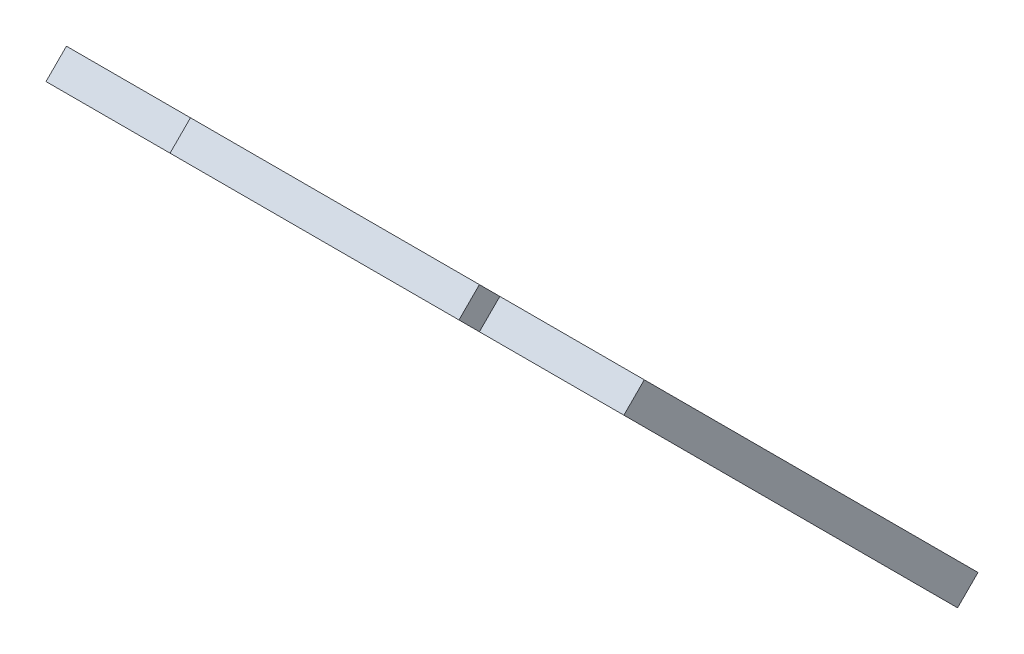
ISO-10303-21;
HEADER;
FILE_DESCRIPTION(('STEP AP214'),'2;1');
FILE_NAME('part.step','',(''),(''),'','','');
FILE_SCHEMA(('AUTOMOTIVE_DESIGN { 1 0 10303 214 1 1 1 1 }'));
ENDSEC;
DATA;
#1=APPLICATION_CONTEXT('core data for automotive mechanical design processes');
#2=APPLICATION_PROTOCOL_DEFINITION('international standard','automotive_design',2000,#1);
#3=PRODUCT_CONTEXT('',#1,'mechanical');
#4=PRODUCT('Part','Part','',(#3));
#5=PRODUCT_RELATED_PRODUCT_CATEGORY('part','',(#4));
#6=PRODUCT_DEFINITION_FORMATION('','',#4);
#7=PRODUCT_DEFINITION_CONTEXT('part definition',#1,'design');
#8=PRODUCT_DEFINITION('design','',#6,#7);
#9=PRODUCT_DEFINITION_SHAPE('','',#8);
#10=(LENGTH_UNIT() NAMED_UNIT(*) SI_UNIT(.MILLI.,.METRE.));
#11=(NAMED_UNIT(*) PLANE_ANGLE_UNIT() SI_UNIT($,.RADIAN.));
#12=(NAMED_UNIT(*) SI_UNIT($,.STERADIAN.) SOLID_ANGLE_UNIT());
#13=UNCERTAINTY_MEASURE_WITH_UNIT(LENGTH_MEASURE(1.E-05),#10,'distance_accuracy_value','');
#14=(GEOMETRIC_REPRESENTATION_CONTEXT(3) GLOBAL_UNCERTAINTY_ASSIGNED_CONTEXT((#13)) GLOBAL_UNIT_ASSIGNED_CONTEXT((#10,
#11,#12)) REPRESENTATION_CONTEXT('',''));
#15=CARTESIAN_POINT('',(0.,0.,0.));
#16=DIRECTION('',(0.,0.,1.));
#17=DIRECTION('',(1.,0.,0.));
#18=AXIS2_PLACEMENT_3D('',#15,#16,#17);
#19=CARTESIAN_POINT('',(0.,105.121320343559,-105.12132034356));
#20=DIRECTION('',(0.,0.707106781186546,-0.707106781186549));
#21=DIRECTION('',(0.,0.707106781186549,0.707106781186546));
#22=AXIS2_PLACEMENT_3D('',#19,#20,#21);
#23=PLANE('',#22);
#24=DIRECTION('',(0.,0.707106781186549,0.707106781186546));
#25=VECTOR('',#24,1.);
#26=CARTESIAN_POINT('',(-60.,175.12132034356,-35.1213203435597));
#27=LINE('',#26,#25);
#28=CARTESIAN_POINT('',(-60.,140.473088065419,-69.7695526217005));
#29=VERTEX_POINT('',#28);
#30=CARTESIAN_POINT('',(-60.,175.12132034356,-35.1213203435597));
#31=VERTEX_POINT('',#30);
#32=EDGE_CURVE('E160',#29,#31,#27,.T.);
#33=ORIENTED_EDGE('',*,*,#32,.T.);
#34=DIRECTION('',(1.,0.,0.));
#35=VECTOR('',#34,1.);
#36=CARTESIAN_POINT('',(-60.,175.12132034356,-35.1213203435597));
#37=LINE('',#36,#35);
#38=CARTESIAN_POINT('',(-45.,175.12132034356,-35.1213203435597));
#39=VERTEX_POINT('',#38);
#40=EDGE_CURVE('E163',#31,#39,#37,.T.);
#41=ORIENTED_EDGE('',*,*,#40,.T.);
#42=DIRECTION('',(0.,0.707106781186547,0.707106781186547));
#43=VECTOR('',#42,1.);
#44=CARTESIAN_POINT('',(-45.,177.242640687119,-33.0000000000001));
#45=LINE('',#44,#43);
#46=CARTESIAN_POINT('',(-45.,177.242640687119,-33.0000000000001));
#47=VERTEX_POINT('',#46);
#48=EDGE_CURVE('E166',#39,#47,#45,.T.);
#49=ORIENTED_EDGE('',*,*,#48,.T.);
#50=DIRECTION('',(1.,0.,0.));
#51=VECTOR('',#50,1.);
#52=CARTESIAN_POINT('',(-15.,177.242640687119,-33.0000000000001));
#53=LINE('',#52,#51);
#54=CARTESIAN_POINT('',(-15.,177.242640687119,-33.0000000000001));
#55=VERTEX_POINT('',#54);
#56=EDGE_CURVE('E168',#47,#55,#53,.T.);
#57=ORIENTED_EDGE('',*,*,#56,.T.);
#58=DIRECTION('',(0.,-0.707106781186547,-0.707106781186547));
#59=VECTOR('',#58,1.);
#60=CARTESIAN_POINT('',(-15.,177.242640687119,-33.0000000000001));
#61=LINE('',#60,#59);
#62=CARTESIAN_POINT('',(-15.,175.12132034356,-35.1213203435597));
#63=VERTEX_POINT('',#62);
#64=EDGE_CURVE('E170',#55,#63,#61,.T.);
#65=ORIENTED_EDGE('',*,*,#64,.T.);
#66=DIRECTION('',(1.,0.,0.));
#67=VECTOR('',#66,1.);
#68=CARTESIAN_POINT('',(0.,175.12132034356,-35.1213203435597));
#69=LINE('',#68,#67);
#70=CARTESIAN_POINT('',(0.,175.12132034356,-35.1213203435597));
#71=VERTEX_POINT('',#70);
#72=EDGE_CURVE('E172',#63,#71,#69,.T.);
#73=ORIENTED_EDGE('',*,*,#72,.T.);
#74=DIRECTION('',(0.,-0.707106781186549,-0.707106781186546));
#75=VECTOR('',#74,1.);
#76=CARTESIAN_POINT('',(0.,175.12132034356,-35.1213203435597));
#77=LINE('',#76,#75);
#78=CARTESIAN_POINT('',(0.,140.473088065419,-69.7695526217005));
#79=VERTEX_POINT('',#78);
#80=EDGE_CURVE('E174',#71,#79,#77,.T.);
#81=ORIENTED_EDGE('',*,*,#80,.T.);
#82=DIRECTION('',(-1.,0.,0.));
#83=VECTOR('',#82,1.);
#84=CARTESIAN_POINT('',(0.,140.473088065419,-69.7695526217005));
#85=LINE('',#84,#83);
#86=EDGE_CURVE('E176',#79,#29,#85,.T.);
#87=ORIENTED_EDGE('',*,*,#86,.T.);
#88=EDGE_LOOP('',(#33,#41,#49,#57,#65,#73,#81,#87));
#89=FACE_BOUND('',#88,.T.);
#90=DIRECTION('',(1.,0.,0.));
#91=VECTOR('',#90,1.);
#92=CARTESIAN_POINT('',(-35.,147.283199846221,-62.9594408408979));
#93=LINE('',#92,#91);
#94=CARTESIAN_POINT('',(-35.,147.283199846221,-62.9594408408979));
#95=VERTEX_POINT('',#94);
#96=CARTESIAN_POINT('',(-15.,147.283199846221,-62.9594408408979));
#97=VERTEX_POINT('',#96);
#98=EDGE_CURVE('E132',#95,#97,#93,.T.);
#99=ORIENTED_EDGE('',*,*,#98,.F.);
#100=DIRECTION('',(0.,0.707106781186549,0.707106781186546));
#101=VECTOR('',#100,1.);
#102=CARTESIAN_POINT('',(-35.,142.12132034356,-68.1213203435596));
#103=LINE('',#102,#101);
#104=CARTESIAN_POINT('',(-35.,142.12132034356,-68.1213203435596));
#105=VERTEX_POINT('',#104);
#106=EDGE_CURVE('E124',#105,#95,#103,.T.);
#107=ORIENTED_EDGE('',*,*,#106,.F.);
#108=DIRECTION('',(-1.,0.,0.));
#109=VECTOR('',#108,1.);
#110=CARTESIAN_POINT('',(-35.,142.12132034356,-68.1213203435596));
#111=LINE('',#110,#109);
#112=CARTESIAN_POINT('',(-15.,142.12132034356,-68.1213203435597));
#113=VERTEX_POINT('',#112);
#114=EDGE_CURVE('E146',#113,#105,#111,.T.);
#115=ORIENTED_EDGE('',*,*,#114,.F.);
#116=DIRECTION('',(0.,-0.707106781186551,-0.707106781186544));
#117=VECTOR('',#116,1.);
#118=CARTESIAN_POINT('',(-15.,142.12132034356,-68.1213203435596));
#119=LINE('',#118,#117);
#120=EDGE_CURVE('E144',#97,#113,#119,.T.);
#121=ORIENTED_EDGE('',*,*,#120,.F.);
#122=EDGE_LOOP('',(#99,#107,#115,#121));
#123=FACE_BOUND('',#122,.T.);
#124=ADVANCED_FACE('F35',(#89,#123),#23,.T.);
#125=CARTESIAN_POINT('',(0.,103.,-103.));
#126=DIRECTION('',(0.,0.707106781186546,-0.707106781186549));
#127=DIRECTION('',(0.,0.707106781186549,0.707106781186546));
#128=AXIS2_PLACEMENT_3D('',#125,#126,#127);
#129=PLANE('',#128);
#130=DIRECTION('',(0.,0.707106781186549,0.707106781186546));
#131=VECTOR('',#130,1.);
#132=CARTESIAN_POINT('',(-60.,173.,-33.0000000000001));
#133=LINE('',#132,#131);
#134=CARTESIAN_POINT('',(-60.,138.351767721859,-67.6482322781409));
#135=VERTEX_POINT('',#134);
#136=CARTESIAN_POINT('',(-60.,173.,-33.0000000000001));
#137=VERTEX_POINT('',#136);
#138=EDGE_CURVE('E140',#135,#137,#133,.T.);
#139=ORIENTED_EDGE('',*,*,#138,.F.);
#140=DIRECTION('',(-1.,0.,0.));
#141=VECTOR('',#140,1.);
#142=CARTESIAN_POINT('',(0.,138.351767721859,-67.6482322781409));
#143=LINE('',#142,#141);
#144=CARTESIAN_POINT('',(0.,138.351767721859,-67.6482322781409));
#145=VERTEX_POINT('',#144);
#146=EDGE_CURVE('E164',#145,#135,#143,.T.);
#147=ORIENTED_EDGE('',*,*,#146,.F.);
#148=DIRECTION('',(0.,-0.707106781186549,-0.707106781186546));
#149=VECTOR('',#148,1.);
#150=CARTESIAN_POINT('',(0.,173.,-33.0000000000001));
#151=LINE('',#150,#149);
#152=CARTESIAN_POINT('',(0.,173.,-33.0000000000001));
#153=VERTEX_POINT('',#152);
#154=EDGE_CURVE('E191',#153,#145,#151,.T.);
#155=ORIENTED_EDGE('',*,*,#154,.F.);
#156=DIRECTION('',(1.,0.,0.));
#157=VECTOR('',#156,1.);
#158=CARTESIAN_POINT('',(0.,173.,-33.0000000000001));
#159=LINE('',#158,#157);
#160=CARTESIAN_POINT('',(-15.,173.,-33.0000000000001));
#161=VERTEX_POINT('',#160);
#162=EDGE_CURVE('E189',#161,#153,#159,.T.);
#163=ORIENTED_EDGE('',*,*,#162,.F.);
#164=DIRECTION('',(0.,-0.707106781186547,-0.707106781186547));
#165=VECTOR('',#164,1.);
#166=CARTESIAN_POINT('',(-15.,175.12132034356,-30.8786796564405));
#167=LINE('',#166,#165);
#168=CARTESIAN_POINT('',(-15.,175.12132034356,-30.8786796564405));
#169=VERTEX_POINT('',#168);
#170=EDGE_CURVE('E187',#169,#161,#167,.T.);
#171=ORIENTED_EDGE('',*,*,#170,.F.);
#172=DIRECTION('',(1.,0.,0.));
#173=VECTOR('',#172,1.);
#174=CARTESIAN_POINT('',(-15.,175.12132034356,-30.8786796564405));
#175=LINE('',#174,#173);
#176=CARTESIAN_POINT('',(-45.,175.12132034356,-30.8786796564405));
#177=VERTEX_POINT('',#176);
#178=EDGE_CURVE('E185',#177,#169,#175,.T.);
#179=ORIENTED_EDGE('',*,*,#178,.F.);
#180=DIRECTION('',(0.,0.707106781186547,0.707106781186547));
#181=VECTOR('',#180,1.);
#182=CARTESIAN_POINT('',(-45.,175.12132034356,-30.8786796564405));
#183=LINE('',#182,#181);
#184=CARTESIAN_POINT('',(-45.,173.,-33.0000000000001));
#185=VERTEX_POINT('',#184);
#186=EDGE_CURVE('E183',#185,#177,#183,.T.);
#187=ORIENTED_EDGE('',*,*,#186,.F.);
#188=DIRECTION('',(1.,0.,0.));
#189=VECTOR('',#188,1.);
#190=CARTESIAN_POINT('',(-60.,173.,-33.0000000000001));
#191=LINE('',#190,#189);
#192=EDGE_CURVE('E181',#137,#185,#191,.T.);
#193=ORIENTED_EDGE('',*,*,#192,.F.);
#194=EDGE_LOOP('',(#139,#147,#155,#163,#171,#179,#187,#193));
#195=FACE_BOUND('',#194,.T.);
#196=DIRECTION('',(0.,0.707106781186549,0.707106781186546));
#197=VECTOR('',#196,1.);
#198=CARTESIAN_POINT('',(-35.,140.,-66.));
#199=LINE('',#198,#197);
#200=CARTESIAN_POINT('',(-35.,140.,-66.));
#201=VERTEX_POINT('',#200);
#202=CARTESIAN_POINT('',(-35.,145.161879502662,-60.8381204973382));
#203=VERTEX_POINT('',#202);
#204=EDGE_CURVE('E58',#201,#203,#199,.T.);
#205=ORIENTED_EDGE('',*,*,#204,.T.);
#206=DIRECTION('',(1.,0.,0.));
#207=VECTOR('',#206,1.);
#208=CARTESIAN_POINT('',(-35.,145.161879502662,-60.8381204973382));
#209=LINE('',#208,#207);
#210=CARTESIAN_POINT('',(-15.,145.161879502662,-60.8381204973382));
#211=VERTEX_POINT('',#210);
#212=EDGE_CURVE('E139',#203,#211,#209,.T.);
#213=ORIENTED_EDGE('',*,*,#212,.T.);
#214=DIRECTION('',(0.,-0.707106781186551,-0.707106781186544));
#215=VECTOR('',#214,1.);
#216=CARTESIAN_POINT('',(-15.,140.,-66.));
#217=LINE('',#216,#215);
#218=CARTESIAN_POINT('',(-15.,140.,-66.));
#219=VERTEX_POINT('',#218);
#220=EDGE_CURVE('E152',#211,#219,#217,.T.);
#221=ORIENTED_EDGE('',*,*,#220,.T.);
#222=DIRECTION('',(-1.,0.,0.));
#223=VECTOR('',#222,1.);
#224=CARTESIAN_POINT('',(-35.,140.,-66.));
#225=LINE('',#224,#223);
#226=EDGE_CURVE('E133',#219,#201,#225,.T.);
#227=ORIENTED_EDGE('',*,*,#226,.T.);
#228=EDGE_LOOP('',(#205,#213,#221,#227));
#229=FACE_BOUND('',#228,.T.);
#230=ADVANCED_FACE('F221',(#195,#229),#129,.F.);
#231=CARTESIAN_POINT('',(-60.,175.12132034356,-35.1213203435597));
#232=DIRECTION('',(1.,0.,0.));
#233=DIRECTION('',(0.,1.,0.));
#234=AXIS2_PLACEMENT_3D('',#231,#232,#233);
#235=PLANE('',#234);
#236=ORIENTED_EDGE('',*,*,#138,.T.);
#237=DIRECTION('',(0.,-0.707106781186546,0.707106781186548));
#238=VECTOR('',#237,1.);
#239=CARTESIAN_POINT('',(-60.,175.12132034356,-35.1213203435597));
#240=LINE('',#239,#238);
#241=EDGE_CURVE('E11',#31,#137,#240,.T.);
#242=ORIENTED_EDGE('',*,*,#241,.F.);
#243=ORIENTED_EDGE('',*,*,#32,.F.);
#244=DIRECTION('',(0.,-0.707106781186546,0.707106781186548));
#245=VECTOR('',#244,1.);
#246=CARTESIAN_POINT('',(-60.,140.473088065419,-69.7695526217005));
#247=LINE('',#246,#245);
#248=EDGE_CURVE('E178',#29,#135,#247,.T.);
#249=ORIENTED_EDGE('',*,*,#248,.T.);
#250=EDGE_LOOP('',(#236,#242,#243,#249));
#251=FACE_BOUND('',#250,.T.);
#252=ADVANCED_FACE('F37',(#251),#235,.F.);
#253=CARTESIAN_POINT('',(-60.,175.12132034356,-35.1213203435597));
#254=DIRECTION('',(0.,-0.707106781186548,-0.707106781186546));
#255=DIRECTION('',(0.,0.707106781186546,-0.707106781186549));
#256=AXIS2_PLACEMENT_3D('',#253,#254,#255);
#257=PLANE('',#256);
#258=ORIENTED_EDGE('',*,*,#192,.T.);
#259=DIRECTION('',(0.,-0.707106781186546,0.707106781186548));
#260=VECTOR('',#259,1.);
#261=CARTESIAN_POINT('',(-45.,175.12132034356,-35.1213203435597));
#262=LINE('',#261,#260);
#263=EDGE_CURVE('E43',#39,#185,#262,.T.);
#264=ORIENTED_EDGE('',*,*,#263,.F.);
#265=ORIENTED_EDGE('',*,*,#40,.F.);
#266=ORIENTED_EDGE('',*,*,#241,.T.);
#267=EDGE_LOOP('',(#258,#264,#265,#266));
#268=FACE_BOUND('',#267,.T.);
#269=ADVANCED_FACE('F238',(#268),#257,.F.);
#270=CARTESIAN_POINT('',(-45.,177.242640687119,-33.0000000000001));
#271=DIRECTION('',(1.,0.,0.));
#272=DIRECTION('',(0.,0.,-1.));
#273=AXIS2_PLACEMENT_3D('',#270,#271,#272);
#274=PLANE('',#273);
#275=ORIENTED_EDGE('',*,*,#186,.T.);
#276=DIRECTION('',(0.,-0.707106781186546,0.707106781186548));
#277=VECTOR('',#276,1.);
#278=CARTESIAN_POINT('',(-45.,177.242640687119,-33.0000000000001));
#279=LINE('',#278,#277);
#280=EDGE_CURVE('E208',#47,#177,#279,.T.);
#281=ORIENTED_EDGE('',*,*,#280,.F.);
#282=ORIENTED_EDGE('',*,*,#48,.F.);
#283=ORIENTED_EDGE('',*,*,#263,.T.);
#284=EDGE_LOOP('',(#275,#281,#282,#283));
#285=FACE_BOUND('',#284,.T.);
#286=ADVANCED_FACE('F215',(#285),#274,.F.);
#287=CARTESIAN_POINT('',(-15.,177.242640687119,-33.0000000000001));
#288=DIRECTION('',(0.,-0.707106781186549,-0.707106781186546));
#289=DIRECTION('',(0.,0.707106781186546,-0.707106781186549));
#290=AXIS2_PLACEMENT_3D('',#287,#288,#289);
#291=PLANE('',#290);
#292=ORIENTED_EDGE('',*,*,#178,.T.);
#293=DIRECTION('',(0.,-0.707106781186546,0.707106781186548));
#294=VECTOR('',#293,1.);
#295=CARTESIAN_POINT('',(-15.,177.242640687119,-33.0000000000001));
#296=LINE('',#295,#294);
#297=EDGE_CURVE('E205',#55,#169,#296,.T.);
#298=ORIENTED_EDGE('',*,*,#297,.F.);
#299=ORIENTED_EDGE('',*,*,#56,.F.);
#300=ORIENTED_EDGE('',*,*,#280,.T.);
#301=EDGE_LOOP('',(#292,#298,#299,#300));
#302=FACE_BOUND('',#301,.T.);
#303=ADVANCED_FACE('F227',(#302),#291,.F.);
#304=CARTESIAN_POINT('',(-15.,177.242640687119,-33.0000000000001));
#305=DIRECTION('',(-1.,0.,0.));
#306=DIRECTION('',(0.,0.,1.));
#307=AXIS2_PLACEMENT_3D('',#304,#305,#306);
#308=PLANE('',#307);
#309=ORIENTED_EDGE('',*,*,#170,.T.);
#310=DIRECTION('',(0.,-0.707106781186546,0.707106781186548));
#311=VECTOR('',#310,1.);
#312=CARTESIAN_POINT('',(-15.,175.12132034356,-35.1213203435597));
#313=LINE('',#312,#311);
#314=EDGE_CURVE('E202',#63,#161,#313,.T.);
#315=ORIENTED_EDGE('',*,*,#314,.F.);
#316=ORIENTED_EDGE('',*,*,#64,.F.);
#317=ORIENTED_EDGE('',*,*,#297,.T.);
#318=EDGE_LOOP('',(#309,#315,#316,#317));
#319=FACE_BOUND('',#318,.T.);
#320=ADVANCED_FACE('F231',(#319),#308,.F.);
#321=CARTESIAN_POINT('',(0.,175.12132034356,-35.1213203435597));
#322=DIRECTION('',(0.,-0.707106781186548,-0.707106781186546));
#323=DIRECTION('',(0.,0.707106781186546,-0.707106781186549));
#324=AXIS2_PLACEMENT_3D('',#321,#322,#323);
#325=PLANE('',#324);
#326=ORIENTED_EDGE('',*,*,#162,.T.);
#327=DIRECTION('',(0.,-0.707106781186546,0.707106781186548));
#328=VECTOR('',#327,1.);
#329=CARTESIAN_POINT('',(0.,175.12132034356,-35.1213203435597));
#330=LINE('',#329,#328);
#331=EDGE_CURVE('E199',#71,#153,#330,.T.);
#332=ORIENTED_EDGE('',*,*,#331,.F.);
#333=ORIENTED_EDGE('',*,*,#72,.F.);
#334=ORIENTED_EDGE('',*,*,#314,.T.);
#335=EDGE_LOOP('',(#326,#332,#333,#334));
#336=FACE_BOUND('',#335,.T.);
#337=ADVANCED_FACE('F251',(#336),#325,.F.);
#338=CARTESIAN_POINT('',(0.,175.12132034356,-35.1213203435597));
#339=DIRECTION('',(-1.,0.,0.));
#340=DIRECTION('',(0.,-1.,0.));
#341=AXIS2_PLACEMENT_3D('',#338,#339,#340);
#342=PLANE('',#341);
#343=ORIENTED_EDGE('',*,*,#154,.T.);
#344=DIRECTION('',(0.,-0.707106781186546,0.707106781186548));
#345=VECTOR('',#344,1.);
#346=CARTESIAN_POINT('',(0.,140.473088065419,-69.7695526217005));
#347=LINE('',#346,#345);
#348=EDGE_CURVE('E196',#79,#145,#347,.T.);
#349=ORIENTED_EDGE('',*,*,#348,.F.);
#350=ORIENTED_EDGE('',*,*,#80,.F.);
#351=ORIENTED_EDGE('',*,*,#331,.T.);
#352=EDGE_LOOP('',(#343,#349,#350,#351));
#353=FACE_BOUND('',#352,.T.);
#354=ADVANCED_FACE('F249',(#353),#342,.F.);
#355=CARTESIAN_POINT('',(0.,140.473088065419,-69.7695526217005));
#356=DIRECTION('',(0.,0.707106781186548,0.707106781186546));
#357=DIRECTION('',(0.,-0.707106781186546,0.707106781186549));
#358=AXIS2_PLACEMENT_3D('',#355,#356,#357);
#359=PLANE('',#358);
#360=ORIENTED_EDGE('',*,*,#146,.T.);
#361=ORIENTED_EDGE('',*,*,#248,.F.);
#362=ORIENTED_EDGE('',*,*,#86,.F.);
#363=ORIENTED_EDGE('',*,*,#348,.T.);
#364=EDGE_LOOP('',(#360,#361,#362,#363));
#365=FACE_BOUND('',#364,.T.);
#366=ADVANCED_FACE('F244',(#365),#359,.F.);
#367=CARTESIAN_POINT('',(-35.,142.12132034356,-68.1213203435596));
#368=DIRECTION('',(1.,0.,0.));
#369=DIRECTION('',(0.,0.,-1.));
#370=AXIS2_PLACEMENT_3D('',#367,#368,#369);
#371=PLANE('',#370);
#372=ORIENTED_EDGE('',*,*,#204,.F.);
#373=DIRECTION('',(0.,-0.707106781186546,0.707106781186548));
#374=VECTOR('',#373,1.);
#375=CARTESIAN_POINT('',(-35.,142.12132034356,-68.1213203435596));
#376=LINE('',#375,#374);
#377=EDGE_CURVE('E128',#105,#201,#376,.T.);
#378=ORIENTED_EDGE('',*,*,#377,.F.);
#379=ORIENTED_EDGE('',*,*,#106,.T.);
#380=DIRECTION('',(0.,-0.707106781186546,0.707106781186548));
#381=VECTOR('',#380,1.);
#382=CARTESIAN_POINT('',(-35.,147.283199846221,-62.9594408408979));
#383=LINE('',#382,#381);
#384=EDGE_CURVE('E127',#95,#203,#383,.T.);
#385=ORIENTED_EDGE('',*,*,#384,.T.);
#386=EDGE_LOOP('',(#372,#378,#379,#385));
#387=FACE_BOUND('',#386,.T.);
#388=ADVANCED_FACE('F126',(#387),#371,.T.);
#389=CARTESIAN_POINT('',(-35.,147.283199846221,-62.9594408408979));
#390=DIRECTION('',(0.,-0.707106781186548,-0.707106781186546));
#391=DIRECTION('',(0.,0.707106781186546,-0.707106781186549));
#392=AXIS2_PLACEMENT_3D('',#389,#390,#391);
#393=PLANE('',#392);
#394=ORIENTED_EDGE('',*,*,#212,.F.);
#395=ORIENTED_EDGE('',*,*,#384,.F.);
#396=ORIENTED_EDGE('',*,*,#98,.T.);
#397=DIRECTION('',(0.,-0.707106781186546,0.707106781186548));
#398=VECTOR('',#397,1.);
#399=CARTESIAN_POINT('',(-15.,147.283199846221,-62.9594408408979));
#400=LINE('',#399,#398);
#401=EDGE_CURVE('E141',#97,#211,#400,.T.);
#402=ORIENTED_EDGE('',*,*,#401,.T.);
#403=EDGE_LOOP('',(#394,#395,#396,#402));
#404=FACE_BOUND('',#403,.T.);
#405=ADVANCED_FACE('F136',(#404),#393,.T.);
#406=CARTESIAN_POINT('',(-15.,142.12132034356,-68.1213203435596));
#407=DIRECTION('',(-1.,0.,0.));
#408=DIRECTION('',(0.,0.,1.));
#409=AXIS2_PLACEMENT_3D('',#406,#407,#408);
#410=PLANE('',#409);
#411=ORIENTED_EDGE('',*,*,#220,.F.);
#412=ORIENTED_EDGE('',*,*,#401,.F.);
#413=ORIENTED_EDGE('',*,*,#120,.T.);
#414=DIRECTION('',(0.,-0.707106781186546,0.707106781186548));
#415=VECTOR('',#414,1.);
#416=CARTESIAN_POINT('',(-15.,142.12132034356,-68.1213203435596));
#417=LINE('',#416,#415);
#418=EDGE_CURVE('E50',#113,#219,#417,.T.);
#419=ORIENTED_EDGE('',*,*,#418,.T.);
#420=EDGE_LOOP('',(#411,#412,#413,#419));
#421=FACE_BOUND('',#420,.T.);
#422=ADVANCED_FACE('F276',(#421),#410,.T.);
#423=CARTESIAN_POINT('',(-35.,142.12132034356,-68.1213203435596));
#424=DIRECTION('',(0.,0.707106781186548,0.707106781186546));
#425=DIRECTION('',(0.,-0.707106781186546,0.707106781186549));
#426=AXIS2_PLACEMENT_3D('',#423,#424,#425);
#427=PLANE('',#426);
#428=ORIENTED_EDGE('',*,*,#226,.F.);
#429=ORIENTED_EDGE('',*,*,#418,.F.);
#430=ORIENTED_EDGE('',*,*,#114,.T.);
#431=ORIENTED_EDGE('',*,*,#377,.T.);
#432=EDGE_LOOP('',(#428,#429,#430,#431));
#433=FACE_BOUND('',#432,.T.);
#434=ADVANCED_FACE('F280',(#433),#427,.T.);
#435=CLOSED_SHELL('',(#124,#230,#252,#269,#286,#303,#320,#337,#354,#366,#388,#405,#422,#434));
#436=MANIFOLD_SOLID_BREP('B2',#435);
#437=ADVANCED_BREP_SHAPE_REPRESENTATION('',(#18,#436),#14);
#438=SHAPE_DEFINITION_REPRESENTATION(#9,#437);
ENDSEC;
END-ISO-10303-21;
